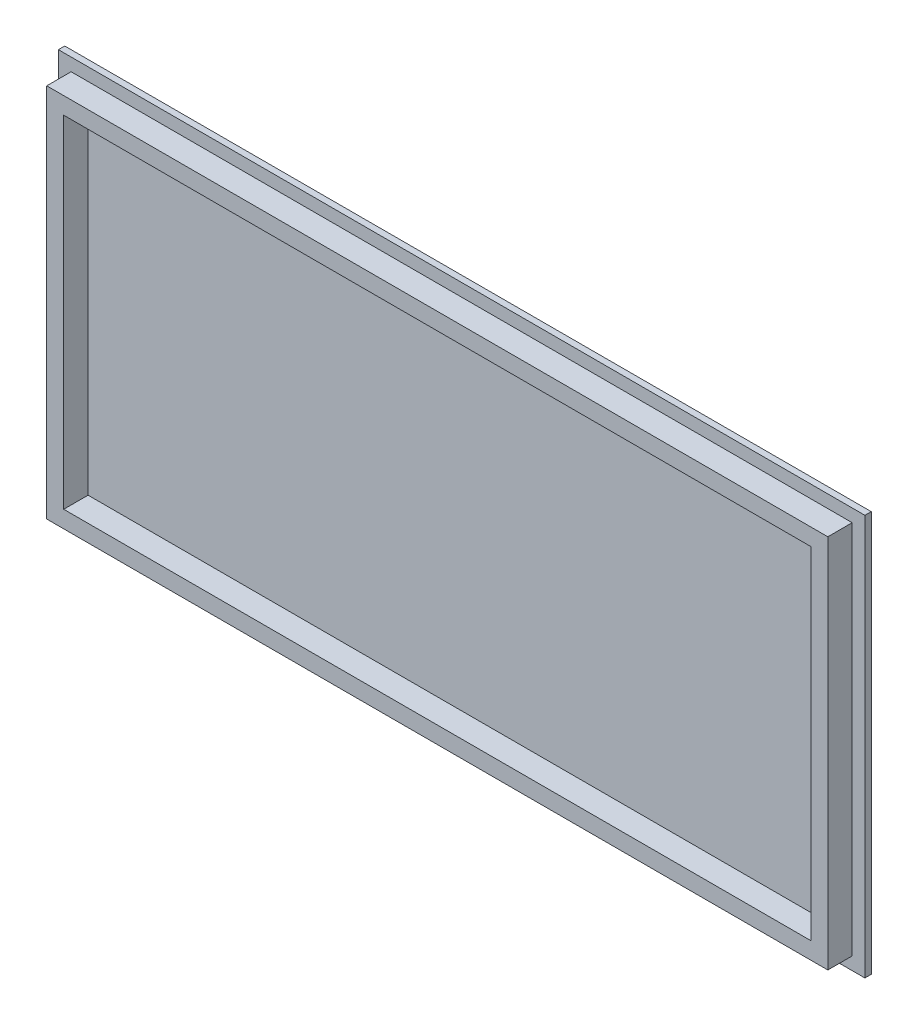
ISO-10303-21;
HEADER;
FILE_DESCRIPTION(('STEP AP214'),'2;1');
FILE_NAME('part.step','',(''),(''),'','','');
FILE_SCHEMA(('AUTOMOTIVE_DESIGN { 1 0 10303 214 1 1 1 1 }'));
ENDSEC;
DATA;
#1=APPLICATION_CONTEXT('core data for automotive mechanical design processes');
#2=APPLICATION_PROTOCOL_DEFINITION('international standard','automotive_design',2000,#1);
#3=PRODUCT_CONTEXT('',#1,'mechanical');
#4=PRODUCT('Part','Part','',(#3));
#5=PRODUCT_RELATED_PRODUCT_CATEGORY('part','',(#4));
#6=PRODUCT_DEFINITION_FORMATION('','',#4);
#7=PRODUCT_DEFINITION_CONTEXT('part definition',#1,'design');
#8=PRODUCT_DEFINITION('design','',#6,#7);
#9=PRODUCT_DEFINITION_SHAPE('','',#8);
#10=(LENGTH_UNIT() NAMED_UNIT(*) SI_UNIT(.MILLI.,.METRE.));
#11=(NAMED_UNIT(*) PLANE_ANGLE_UNIT() SI_UNIT($,.RADIAN.));
#12=(NAMED_UNIT(*) SI_UNIT($,.STERADIAN.) SOLID_ANGLE_UNIT());
#13=UNCERTAINTY_MEASURE_WITH_UNIT(LENGTH_MEASURE(1.E-05),#10,'distance_accuracy_value','');
#14=(GEOMETRIC_REPRESENTATION_CONTEXT(3) GLOBAL_UNCERTAINTY_ASSIGNED_CONTEXT((#13)) GLOBAL_UNIT_ASSIGNED_CONTEXT((#10,
#11,#12)) REPRESENTATION_CONTEXT('',''));
#15=CARTESIAN_POINT('',(0.,0.,0.));
#16=DIRECTION('',(0.,0.,1.));
#17=DIRECTION('',(1.,0.,0.));
#18=AXIS2_PLACEMENT_3D('',#15,#16,#17);
#19=CARTESIAN_POINT('',(0.,0.,3.));
#20=DIRECTION('',(0.,0.,-1.));
#21=DIRECTION('',(-1.,0.,0.));
#22=AXIS2_PLACEMENT_3D('',#19,#20,#21);
#23=PLANE('',#22);
#24=DIRECTION('',(-1.,0.,0.));
#25=VECTOR('',#24,1.);
#26=CARTESIAN_POINT('',(374.050306962926,-6.24484427014717,3.));
#27=LINE('',#26,#25);
#28=CARTESIAN_POINT('',(374.050306962926,-6.24484427014717,3.));
#29=VERTEX_POINT('',#28);
#30=CARTESIAN_POINT('',(-6.41969303707377,-6.24484427014722,3.));
#31=VERTEX_POINT('',#30);
#32=EDGE_CURVE('E195',#29,#31,#27,.T.);
#33=ORIENTED_EDGE('',*,*,#32,.F.);
#34=DIRECTION('',(0.,1.,0.));
#35=VECTOR('',#34,1.);
#36=CARTESIAN_POINT('',(374.050306962926,-6.24484427014717,3.));
#37=LINE('',#36,#35);
#38=CARTESIAN_POINT('',(374.050306962926,182.795155729853,3.));
#39=VERTEX_POINT('',#38);
#40=EDGE_CURVE('E204',#29,#39,#37,.T.);
#41=ORIENTED_EDGE('',*,*,#40,.T.);
#42=DIRECTION('',(-1.,0.,0.));
#43=VECTOR('',#42,1.);
#44=CARTESIAN_POINT('',(374.050306962926,182.795155729853,3.));
#45=LINE('',#44,#43);
#46=CARTESIAN_POINT('',(-6.41969303707379,182.795155729853,3.));
#47=VERTEX_POINT('',#46);
#48=EDGE_CURVE('E202',#39,#47,#45,.T.);
#49=ORIENTED_EDGE('',*,*,#48,.T.);
#50=DIRECTION('',(0.,1.,0.));
#51=VECTOR('',#50,1.);
#52=CARTESIAN_POINT('',(-6.41969303707377,-6.24484427014722,3.));
#53=LINE('',#52,#51);
#54=EDGE_CURVE('E198',#31,#47,#53,.T.);
#55=ORIENTED_EDGE('',*,*,#54,.F.);
#56=EDGE_LOOP('',(#33,#41,#49,#55));
#57=FACE_BOUND('',#56,.T.);
#58=DIRECTION('',(0.,-1.,0.));
#59=VECTOR('',#58,1.);
#60=CARTESIAN_POINT('',(-0.424693037073737,-0.229844270147245,3.));
#61=LINE('',#60,#59);
#62=CARTESIAN_POINT('',(-0.424693037073721,176.780155729853,3.));
#63=VERTEX_POINT('',#62);
#64=CARTESIAN_POINT('',(-0.424693037073737,-0.229844270147245,3.));
#65=VERTEX_POINT('',#64);
#66=EDGE_CURVE('E61',#63,#65,#61,.T.);
#67=ORIENTED_EDGE('',*,*,#66,.F.);
#68=DIRECTION('',(-1.,0.,0.));
#69=VECTOR('',#68,1.);
#70=CARTESIAN_POINT('',(368.055306962926,176.780155729853,3.));
#71=LINE('',#70,#69);
#72=CARTESIAN_POINT('',(368.055306962926,176.780155729853,3.));
#73=VERTEX_POINT('',#72);
#74=EDGE_CURVE('E168',#73,#63,#71,.T.);
#75=ORIENTED_EDGE('',*,*,#74,.F.);
#76=DIRECTION('',(0.,1.,0.));
#77=VECTOR('',#76,1.);
#78=CARTESIAN_POINT('',(368.055306962926,-0.229844270147203,3.));
#79=LINE('',#78,#77);
#80=CARTESIAN_POINT('',(368.055306962926,-0.229844270147203,3.));
#81=VERTEX_POINT('',#80);
#82=EDGE_CURVE('E179',#81,#73,#79,.T.);
#83=ORIENTED_EDGE('',*,*,#82,.F.);
#84=DIRECTION('',(1.,0.,0.));
#85=VECTOR('',#84,1.);
#86=CARTESIAN_POINT('',(368.055306962926,-0.229844270147203,3.));
#87=LINE('',#86,#85);
#88=EDGE_CURVE('E176',#65,#81,#87,.T.);
#89=ORIENTED_EDGE('',*,*,#88,.F.);
#90=EDGE_LOOP('',(#67,#75,#83,#89));
#91=FACE_BOUND('',#90,.T.);
#92=ADVANCED_FACE('F36',(#57,#91),#23,.F.);
#93=CARTESIAN_POINT('',(374.050306962926,-6.24484427014717,3.));
#94=DIRECTION('',(0.,-1.,0.));
#95=DIRECTION('',(1.,0.,0.));
#96=AXIS2_PLACEMENT_3D('',#93,#94,#95);
#97=PLANE('',#96);
#98=DIRECTION('',(-1.,0.,0.));
#99=VECTOR('',#98,1.);
#100=CARTESIAN_POINT('',(374.050306962926,-6.24484427014717,0.));
#101=LINE('',#100,#99);
#102=CARTESIAN_POINT('',(374.050306962926,-6.24484427014717,0.));
#103=VERTEX_POINT('',#102);
#104=CARTESIAN_POINT('',(-6.41969303707377,-6.24484427014722,0.));
#105=VERTEX_POINT('',#104);
#106=EDGE_CURVE('E194',#103,#105,#101,.T.);
#107=ORIENTED_EDGE('',*,*,#106,.F.);
#108=DIRECTION('',(0.,0.,-1.));
#109=VECTOR('',#108,1.);
#110=CARTESIAN_POINT('',(374.050306962926,-6.24484427014717,3.));
#111=LINE('',#110,#109);
#112=EDGE_CURVE('E11',#29,#103,#111,.T.);
#113=ORIENTED_EDGE('',*,*,#112,.F.);
#114=ORIENTED_EDGE('',*,*,#32,.T.);
#115=DIRECTION('',(0.,0.,-1.));
#116=VECTOR('',#115,1.);
#117=CARTESIAN_POINT('',(-6.41969303707377,-6.24484427014722,3.));
#118=LINE('',#117,#116);
#119=EDGE_CURVE('E40',#31,#105,#118,.T.);
#120=ORIENTED_EDGE('',*,*,#119,.T.);
#121=EDGE_LOOP('',(#107,#113,#114,#120));
#122=FACE_BOUND('',#121,.T.);
#123=ADVANCED_FACE('F38',(#122),#97,.T.);
#124=CARTESIAN_POINT('',(374.050306962926,-6.24484427014717,3.));
#125=DIRECTION('',(-1.,0.,0.));
#126=DIRECTION('',(0.,0.,1.));
#127=AXIS2_PLACEMENT_3D('',#124,#125,#126);
#128=PLANE('',#127);
#129=DIRECTION('',(0.,1.,0.));
#130=VECTOR('',#129,1.);
#131=CARTESIAN_POINT('',(374.050306962926,-6.24484427014717,0.));
#132=LINE('',#131,#130);
#133=CARTESIAN_POINT('',(374.050306962926,182.795155729853,0.));
#134=VERTEX_POINT('',#133);
#135=EDGE_CURVE('E199',#103,#134,#132,.T.);
#136=ORIENTED_EDGE('',*,*,#135,.T.);
#137=DIRECTION('',(0.,0.,-1.));
#138=VECTOR('',#137,1.);
#139=CARTESIAN_POINT('',(374.050306962926,182.795155729853,3.));
#140=LINE('',#139,#138);
#141=EDGE_CURVE('E45',#39,#134,#140,.T.);
#142=ORIENTED_EDGE('',*,*,#141,.F.);
#143=ORIENTED_EDGE('',*,*,#40,.F.);
#144=ORIENTED_EDGE('',*,*,#112,.T.);
#145=EDGE_LOOP('',(#136,#142,#143,#144));
#146=FACE_BOUND('',#145,.T.);
#147=ADVANCED_FACE('F231',(#146),#128,.F.);
#148=CARTESIAN_POINT('',(374.050306962926,182.795155729853,3.));
#149=DIRECTION('',(0.,-1.,0.));
#150=DIRECTION('',(1.,0.,0.));
#151=AXIS2_PLACEMENT_3D('',#148,#149,#150);
#152=PLANE('',#151);
#153=DIRECTION('',(-1.,0.,0.));
#154=VECTOR('',#153,1.);
#155=CARTESIAN_POINT('',(374.050306962926,182.795155729853,0.));
#156=LINE('',#155,#154);
#157=CARTESIAN_POINT('',(-6.41969303707379,182.795155729853,0.));
#158=VERTEX_POINT('',#157);
#159=EDGE_CURVE('E211',#134,#158,#156,.T.);
#160=ORIENTED_EDGE('',*,*,#159,.T.);
#161=DIRECTION('',(0.,0.,-1.));
#162=VECTOR('',#161,1.);
#163=CARTESIAN_POINT('',(-6.41969303707379,182.795155729853,3.));
#164=LINE('',#163,#162);
#165=EDGE_CURVE('E216',#47,#158,#164,.T.);
#166=ORIENTED_EDGE('',*,*,#165,.F.);
#167=ORIENTED_EDGE('',*,*,#48,.F.);
#168=ORIENTED_EDGE('',*,*,#141,.T.);
#169=EDGE_LOOP('',(#160,#166,#167,#168));
#170=FACE_BOUND('',#169,.T.);
#171=ADVANCED_FACE('F235',(#170),#152,.F.);
#172=CARTESIAN_POINT('',(-6.41969303707377,-6.24484427014722,3.));
#173=DIRECTION('',(-1.,0.,0.));
#174=DIRECTION('',(0.,-1.,0.));
#175=AXIS2_PLACEMENT_3D('',#172,#173,#174);
#176=PLANE('',#175);
#177=DIRECTION('',(0.,1.,0.));
#178=VECTOR('',#177,1.);
#179=CARTESIAN_POINT('',(-6.41969303707377,-6.24484427014722,0.));
#180=LINE('',#179,#178);
#181=EDGE_CURVE('E208',#105,#158,#180,.T.);
#182=ORIENTED_EDGE('',*,*,#181,.F.);
#183=ORIENTED_EDGE('',*,*,#119,.F.);
#184=ORIENTED_EDGE('',*,*,#54,.T.);
#185=ORIENTED_EDGE('',*,*,#165,.T.);
#186=EDGE_LOOP('',(#182,#183,#184,#185));
#187=FACE_BOUND('',#186,.T.);
#188=ADVANCED_FACE('F224',(#187),#176,.T.);
#189=CARTESIAN_POINT('',(0.,0.,0.));
#190=DIRECTION('',(0.,0.,-1.));
#191=DIRECTION('',(-1.,0.,0.));
#192=AXIS2_PLACEMENT_3D('',#189,#190,#191);
#193=PLANE('',#192);
#194=ORIENTED_EDGE('',*,*,#106,.T.);
#195=ORIENTED_EDGE('',*,*,#181,.T.);
#196=ORIENTED_EDGE('',*,*,#159,.F.);
#197=ORIENTED_EDGE('',*,*,#135,.F.);
#198=EDGE_LOOP('',(#194,#195,#196,#197));
#199=FACE_BOUND('',#198,.T.);
#200=ADVANCED_FACE('F228',(#199),#193,.T.);
#201=CARTESIAN_POINT('',(-0.424693037073737,-0.229844270147245,14.5));
#202=DIRECTION('',(1.,0.,0.));
#203=DIRECTION('',(0.,1.,0.));
#204=AXIS2_PLACEMENT_3D('',#201,#202,#203);
#205=PLANE('',#204);
#206=ORIENTED_EDGE('',*,*,#66,.T.);
#207=DIRECTION('',(0.,0.,-1.));
#208=VECTOR('',#207,1.);
#209=CARTESIAN_POINT('',(-0.424693037073737,-0.229844270147245,14.5));
#210=LINE('',#209,#208);
#211=CARTESIAN_POINT('',(-0.424693037073737,-0.229844270147245,14.5));
#212=VERTEX_POINT('',#211);
#213=EDGE_CURVE('E191',#212,#65,#210,.T.);
#214=ORIENTED_EDGE('',*,*,#213,.F.);
#215=DIRECTION('',(0.,-1.,0.));
#216=VECTOR('',#215,1.);
#217=CARTESIAN_POINT('',(-0.424693037073737,-0.229844270147245,14.5));
#218=LINE('',#217,#216);
#219=CARTESIAN_POINT('',(-0.424693037073721,176.780155729853,14.5));
#220=VERTEX_POINT('',#219);
#221=EDGE_CURVE('E164',#220,#212,#218,.T.);
#222=ORIENTED_EDGE('',*,*,#221,.F.);
#223=DIRECTION('',(0.,0.,-1.));
#224=VECTOR('',#223,1.);
#225=CARTESIAN_POINT('',(-0.424693037073721,176.780155729853,14.5));
#226=LINE('',#225,#224);
#227=EDGE_CURVE('E174',#220,#63,#226,.T.);
#228=ORIENTED_EDGE('',*,*,#227,.T.);
#229=EDGE_LOOP('',(#206,#214,#222,#228));
#230=FACE_BOUND('',#229,.T.);
#231=ADVANCED_FACE('F244',(#230),#205,.F.);
#232=CARTESIAN_POINT('',(368.055306962926,-0.229844270147203,14.5));
#233=DIRECTION('',(0.,1.,0.));
#234=DIRECTION('',(-1.,0.,0.));
#235=AXIS2_PLACEMENT_3D('',#232,#233,#234);
#236=PLANE('',#235);
#237=ORIENTED_EDGE('',*,*,#88,.T.);
#238=DIRECTION('',(0.,0.,-1.));
#239=VECTOR('',#238,1.);
#240=CARTESIAN_POINT('',(368.055306962926,-0.229844270147203,14.5));
#241=LINE('',#240,#239);
#242=CARTESIAN_POINT('',(368.055306962926,-0.229844270147203,14.5));
#243=VERTEX_POINT('',#242);
#244=EDGE_CURVE('E188',#243,#81,#241,.T.);
#245=ORIENTED_EDGE('',*,*,#244,.F.);
#246=DIRECTION('',(1.,0.,0.));
#247=VECTOR('',#246,1.);
#248=CARTESIAN_POINT('',(368.055306962926,-0.229844270147203,14.5));
#249=LINE('',#248,#247);
#250=EDGE_CURVE('E167',#212,#243,#249,.T.);
#251=ORIENTED_EDGE('',*,*,#250,.F.);
#252=ORIENTED_EDGE('',*,*,#213,.T.);
#253=EDGE_LOOP('',(#237,#245,#251,#252));
#254=FACE_BOUND('',#253,.T.);
#255=ADVANCED_FACE('F266',(#254),#236,.F.);
#256=CARTESIAN_POINT('',(368.055306962926,-0.229844270147203,14.5));
#257=DIRECTION('',(-1.,0.,0.));
#258=DIRECTION('',(0.,0.,1.));
#259=AXIS2_PLACEMENT_3D('',#256,#257,#258);
#260=PLANE('',#259);
#261=ORIENTED_EDGE('',*,*,#82,.T.);
#262=DIRECTION('',(0.,0.,-1.));
#263=VECTOR('',#262,1.);
#264=CARTESIAN_POINT('',(368.055306962926,176.780155729853,14.5));
#265=LINE('',#264,#263);
#266=CARTESIAN_POINT('',(368.055306962926,176.780155729853,14.5));
#267=VERTEX_POINT('',#266);
#268=EDGE_CURVE('E185',#267,#73,#265,.T.);
#269=ORIENTED_EDGE('',*,*,#268,.F.);
#270=DIRECTION('',(0.,1.,0.));
#271=VECTOR('',#270,1.);
#272=CARTESIAN_POINT('',(368.055306962926,-0.229844270147203,14.5));
#273=LINE('',#272,#271);
#274=EDGE_CURVE('E170',#243,#267,#273,.T.);
#275=ORIENTED_EDGE('',*,*,#274,.F.);
#276=ORIENTED_EDGE('',*,*,#244,.T.);
#277=EDGE_LOOP('',(#261,#269,#275,#276));
#278=FACE_BOUND('',#277,.T.);
#279=ADVANCED_FACE('F273',(#278),#260,.F.);
#280=CARTESIAN_POINT('',(368.055306962926,176.780155729853,14.5));
#281=DIRECTION('',(0.,-1.,0.));
#282=DIRECTION('',(0.,0.,-1.));
#283=AXIS2_PLACEMENT_3D('',#280,#281,#282);
#284=PLANE('',#283);
#285=ORIENTED_EDGE('',*,*,#74,.T.);
#286=ORIENTED_EDGE('',*,*,#227,.F.);
#287=DIRECTION('',(-1.,0.,0.));
#288=VECTOR('',#287,1.);
#289=CARTESIAN_POINT('',(368.055306962926,176.780155729853,14.5));
#290=LINE('',#289,#288);
#291=EDGE_CURVE('E172',#267,#220,#290,.T.);
#292=ORIENTED_EDGE('',*,*,#291,.F.);
#293=ORIENTED_EDGE('',*,*,#268,.T.);
#294=EDGE_LOOP('',(#285,#286,#292,#293));
#295=FACE_BOUND('',#294,.T.);
#296=ADVANCED_FACE('F280',(#295),#284,.F.);
#297=CARTESIAN_POINT('',(0.,0.,14.5));
#298=DIRECTION('',(0.,0.,1.));
#299=DIRECTION('',(1.,0.,0.));
#300=AXIS2_PLACEMENT_3D('',#297,#298,#299);
#301=PLANE('',#300);
#302=DIRECTION('',(-1.,0.,0.));
#303=VECTOR('',#302,1.);
#304=CARTESIAN_POINT('',(360.055306962926,168.780155729853,14.5));
#305=LINE('',#304,#303);
#306=CARTESIAN_POINT('',(360.055306962926,168.780155729853,14.5));
#307=VERTEX_POINT('',#306);
#308=CARTESIAN_POINT('',(7.57530696292628,168.780155729853,14.5));
#309=VERTEX_POINT('',#308);
#310=EDGE_CURVE('E53',#307,#309,#305,.T.);
#311=ORIENTED_EDGE('',*,*,#310,.F.);
#312=DIRECTION('',(0.,1.,0.));
#313=VECTOR('',#312,1.);
#314=CARTESIAN_POINT('',(360.055306962926,7.7701557298528,14.5));
#315=LINE('',#314,#313);
#316=CARTESIAN_POINT('',(360.055306962926,7.7701557298528,14.5));
#317=VERTEX_POINT('',#316);
#318=EDGE_CURVE('E146',#317,#307,#315,.T.);
#319=ORIENTED_EDGE('',*,*,#318,.F.);
#320=DIRECTION('',(1.,0.,0.));
#321=VECTOR('',#320,1.);
#322=CARTESIAN_POINT('',(7.57530696292626,7.77015572985276,14.5));
#323=LINE('',#322,#321);
#324=CARTESIAN_POINT('',(7.57530696292626,7.77015572985276,14.5));
#325=VERTEX_POINT('',#324);
#326=EDGE_CURVE('E149',#325,#317,#323,.T.);
#327=ORIENTED_EDGE('',*,*,#326,.F.);
#328=DIRECTION('',(0.,-1.,0.));
#329=VECTOR('',#328,1.);
#330=CARTESIAN_POINT('',(7.57530696292628,168.780155729853,14.5));
#331=LINE('',#330,#329);
#332=EDGE_CURVE('E155',#309,#325,#331,.T.);
#333=ORIENTED_EDGE('',*,*,#332,.F.);
#334=EDGE_LOOP('',(#311,#319,#327,#333));
#335=FACE_BOUND('',#334,.T.);
#336=ORIENTED_EDGE('',*,*,#221,.T.);
#337=ORIENTED_EDGE('',*,*,#250,.T.);
#338=ORIENTED_EDGE('',*,*,#274,.T.);
#339=ORIENTED_EDGE('',*,*,#291,.T.);
#340=EDGE_LOOP('',(#336,#337,#338,#339));
#341=FACE_BOUND('',#340,.T.);
#342=ADVANCED_FACE('F288',(#335,#341),#301,.T.);
#343=CARTESIAN_POINT('',(360.055306962926,168.780155729853,3.));
#344=DIRECTION('',(0.,1.,0.));
#345=DIRECTION('',(0.,0.,1.));
#346=AXIS2_PLACEMENT_3D('',#343,#344,#345);
#347=PLANE('',#346);
#348=ORIENTED_EDGE('',*,*,#310,.T.);
#349=DIRECTION('',(0.,0.,1.));
#350=VECTOR('',#349,1.);
#351=CARTESIAN_POINT('',(7.57530696292628,168.780155729853,3.));
#352=LINE('',#351,#350);
#353=CARTESIAN_POINT('',(7.57530696292628,168.780155729853,3.));
#354=VERTEX_POINT('',#353);
#355=EDGE_CURVE('E124',#354,#309,#352,.T.);
#356=ORIENTED_EDGE('',*,*,#355,.F.);
#357=DIRECTION('',(-1.,0.,0.));
#358=VECTOR('',#357,1.);
#359=CARTESIAN_POINT('',(360.055306962926,168.780155729853,3.));
#360=LINE('',#359,#358);
#361=CARTESIAN_POINT('',(360.055306962926,168.780155729853,3.));
#362=VERTEX_POINT('',#361);
#363=EDGE_CURVE('E128',#362,#354,#360,.T.);
#364=ORIENTED_EDGE('',*,*,#363,.F.);
#365=DIRECTION('',(0.,0.,1.));
#366=VECTOR('',#365,1.);
#367=CARTESIAN_POINT('',(360.055306962926,168.780155729853,3.));
#368=LINE('',#367,#366);
#369=EDGE_CURVE('E159',#362,#307,#368,.T.);
#370=ORIENTED_EDGE('',*,*,#369,.T.);
#371=EDGE_LOOP('',(#348,#356,#364,#370));
#372=FACE_BOUND('',#371,.T.);
#373=ADVANCED_FACE('F126',(#372),#347,.F.);
#374=CARTESIAN_POINT('',(360.055306962926,7.7701557298528,3.));
#375=DIRECTION('',(1.,0.,0.));
#376=DIRECTION('',(0.,0.,-1.));
#377=AXIS2_PLACEMENT_3D('',#374,#375,#376);
#378=PLANE('',#377);
#379=ORIENTED_EDGE('',*,*,#318,.T.);
#380=ORIENTED_EDGE('',*,*,#369,.F.);
#381=DIRECTION('',(0.,1.,0.));
#382=VECTOR('',#381,1.);
#383=CARTESIAN_POINT('',(360.055306962926,7.7701557298528,3.));
#384=LINE('',#383,#382);
#385=CARTESIAN_POINT('',(360.055306962926,7.7701557298528,3.));
#386=VERTEX_POINT('',#385);
#387=EDGE_CURVE('E134',#386,#362,#384,.T.);
#388=ORIENTED_EDGE('',*,*,#387,.F.);
#389=DIRECTION('',(0.,0.,1.));
#390=VECTOR('',#389,1.);
#391=CARTESIAN_POINT('',(360.055306962926,7.7701557298528,3.));
#392=LINE('',#391,#390);
#393=EDGE_CURVE('E161',#386,#317,#392,.T.);
#394=ORIENTED_EDGE('',*,*,#393,.T.);
#395=EDGE_LOOP('',(#379,#380,#388,#394));
#396=FACE_BOUND('',#395,.T.);
#397=ADVANCED_FACE('F303',(#396),#378,.F.);
#398=CARTESIAN_POINT('',(7.57530696292626,7.77015572985276,3.));
#399=DIRECTION('',(0.,-1.,0.));
#400=DIRECTION('',(1.,0.,0.));
#401=AXIS2_PLACEMENT_3D('',#398,#399,#400);
#402=PLANE('',#401);
#403=ORIENTED_EDGE('',*,*,#326,.T.);
#404=ORIENTED_EDGE('',*,*,#393,.F.);
#405=DIRECTION('',(1.,0.,0.));
#406=VECTOR('',#405,1.);
#407=CARTESIAN_POINT('',(7.57530696292626,7.77015572985276,3.));
#408=LINE('',#407,#406);
#409=CARTESIAN_POINT('',(7.57530696292626,7.77015572985276,3.));
#410=VERTEX_POINT('',#409);
#411=EDGE_CURVE('E142',#410,#386,#408,.T.);
#412=ORIENTED_EDGE('',*,*,#411,.F.);
#413=DIRECTION('',(0.,0.,1.));
#414=VECTOR('',#413,1.);
#415=CARTESIAN_POINT('',(7.57530696292626,7.77015572985276,3.));
#416=LINE('',#415,#414);
#417=EDGE_CURVE('E133',#410,#325,#416,.T.);
#418=ORIENTED_EDGE('',*,*,#417,.T.);
#419=EDGE_LOOP('',(#403,#404,#412,#418));
#420=FACE_BOUND('',#419,.T.);
#421=ADVANCED_FACE('F310',(#420),#402,.F.);
#422=CARTESIAN_POINT('',(7.57530696292628,168.780155729853,3.));
#423=DIRECTION('',(-1.,0.,0.));
#424=DIRECTION('',(0.,-1.,0.));
#425=AXIS2_PLACEMENT_3D('',#422,#423,#424);
#426=PLANE('',#425);
#427=ORIENTED_EDGE('',*,*,#332,.T.);
#428=ORIENTED_EDGE('',*,*,#417,.F.);
#429=DIRECTION('',(0.,-1.,0.));
#430=VECTOR('',#429,1.);
#431=CARTESIAN_POINT('',(7.57530696292628,168.780155729853,3.));
#432=LINE('',#431,#430);
#433=EDGE_CURVE('E137',#354,#410,#432,.T.);
#434=ORIENTED_EDGE('',*,*,#433,.F.);
#435=ORIENTED_EDGE('',*,*,#355,.T.);
#436=EDGE_LOOP('',(#427,#428,#434,#435));
#437=FACE_BOUND('',#436,.T.);
#438=ADVANCED_FACE('F138',(#437),#426,.F.);
#439=CARTESIAN_POINT('',(0.,0.,3.));
#440=DIRECTION('',(0.,0.,1.));
#441=DIRECTION('',(1.,0.,0.));
#442=AXIS2_PLACEMENT_3D('',#439,#440,#441);
#443=PLANE('',#442);
#444=ORIENTED_EDGE('',*,*,#363,.T.);
#445=ORIENTED_EDGE('',*,*,#433,.T.);
#446=ORIENTED_EDGE('',*,*,#411,.T.);
#447=ORIENTED_EDGE('',*,*,#387,.T.);
#448=EDGE_LOOP('',(#444,#445,#446,#447));
#449=FACE_BOUND('',#448,.T.);
#450=ADVANCED_FACE('F144',(#449),#443,.T.);
#451=CLOSED_SHELL('',(#92,#123,#147,#171,#188,#200,#231,#255,#279,#296,#342,#373,#397,#421,#438,#450));
#452=MANIFOLD_SOLID_BREP('B2',#451);
#453=ADVANCED_BREP_SHAPE_REPRESENTATION('',(#18,#452),#14);
#454=SHAPE_DEFINITION_REPRESENTATION(#9,#453);
ENDSEC;
END-ISO-10303-21;
